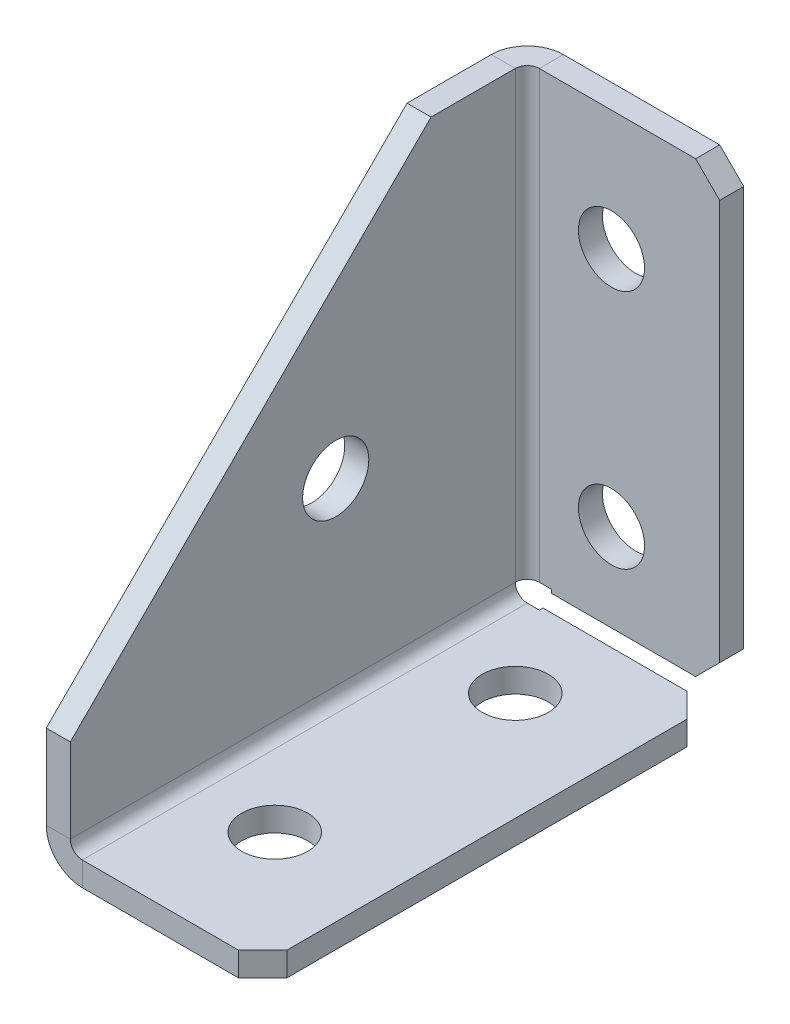
ISO-10303-21;
HEADER;
FILE_DESCRIPTION(('STEP AP214'),'2;1');
FILE_NAME('part.step','',(''),(''),'','','');
FILE_SCHEMA(('AUTOMOTIVE_DESIGN { 1 0 10303 214 1 1 1 1 }'));
ENDSEC;
DATA;
#1=APPLICATION_CONTEXT('core data for automotive mechanical design processes');
#2=APPLICATION_PROTOCOL_DEFINITION('international standard','automotive_design',2000,#1);
#3=PRODUCT_CONTEXT('',#1,'mechanical');
#4=PRODUCT('Part','Part','',(#3));
#5=PRODUCT_RELATED_PRODUCT_CATEGORY('part','',(#4));
#6=PRODUCT_DEFINITION_FORMATION('','',#4);
#7=PRODUCT_DEFINITION_CONTEXT('part definition',#1,'design');
#8=PRODUCT_DEFINITION('design','',#6,#7);
#9=PRODUCT_DEFINITION_SHAPE('','',#8);
#10=(LENGTH_UNIT() NAMED_UNIT(*) SI_UNIT(.MILLI.,.METRE.));
#11=(NAMED_UNIT(*) PLANE_ANGLE_UNIT() SI_UNIT($,.RADIAN.));
#12=(NAMED_UNIT(*) SI_UNIT($,.STERADIAN.) SOLID_ANGLE_UNIT());
#13=UNCERTAINTY_MEASURE_WITH_UNIT(LENGTH_MEASURE(1.E-05),#10,'distance_accuracy_value','');
#14=(GEOMETRIC_REPRESENTATION_CONTEXT(3) GLOBAL_UNCERTAINTY_ASSIGNED_CONTEXT((#13)) GLOBAL_UNIT_ASSIGNED_CONTEXT((#10,
#11,#12)) REPRESENTATION_CONTEXT('',''));
#15=CARTESIAN_POINT('',(0.,0.,0.));
#16=DIRECTION('',(0.,0.,1.));
#17=DIRECTION('',(1.,0.,0.));
#18=AXIS2_PLACEMENT_3D('',#15,#16,#17);
#19=CARTESIAN_POINT('',(3.,3.,2.99999999999998));
#20=DIRECTION('',(0.,0.,1.));
#21=DIRECTION('',(0.,-1.,0.));
#22=AXIS2_PLACEMENT_3D('',#19,#20,#21);
#23=PLANE('',#22);
#24=DIRECTION('',(-1.,0.,0.));
#25=VECTOR('',#24,1.);
#26=CARTESIAN_POINT('',(0.,2.99999999999998,2.99999999999998));
#27=LINE('',#26,#25);
#28=CARTESIAN_POINT('',(2.,2.99999999999998,2.99999999999999));
#29=VERTEX_POINT('',#28);
#30=CARTESIAN_POINT('',(0.,2.99999999999998,2.99999999999998));
#31=VERTEX_POINT('',#30);
#32=EDGE_CURVE('E411',#29,#31,#27,.T.);
#33=ORIENTED_EDGE('',*,*,#32,.F.);
#34=CARTESIAN_POINT('',(3.,3.,2.99999999999998));
#35=DIRECTION('',(0.,0.,-1.));
#36=DIRECTION('',(-1.,0.,0.));
#37=AXIS2_PLACEMENT_3D('',#34,#35,#36);
#38=CIRCLE('',#37,1.);
#39=CARTESIAN_POINT('',(3.,2.,2.99999999999998));
#40=VERTEX_POINT('',#39);
#41=EDGE_CURVE('E353',#29,#40,#38,.F.);
#42=ORIENTED_EDGE('',*,*,#41,.T.);
#43=DIRECTION('',(0.,-1.,0.));
#44=VECTOR('',#43,1.);
#45=CARTESIAN_POINT('',(3.,0.,2.99999999999998));
#46=LINE('',#45,#44);
#47=CARTESIAN_POINT('',(3.,0.,2.99999999999998));
#48=VERTEX_POINT('',#47);
#49=EDGE_CURVE('E408',#40,#48,#46,.T.);
#50=ORIENTED_EDGE('',*,*,#49,.T.);
#51=CARTESIAN_POINT('',(3.,3.,2.99999999999998));
#52=DIRECTION('',(0.,0.,-1.));
#53=DIRECTION('',(0.,1.,0.));
#54=AXIS2_PLACEMENT_3D('',#51,#52,#53);
#55=CIRCLE('',#54,3.);
#56=EDGE_CURVE('E291',#31,#48,#55,.F.);
#57=ORIENTED_EDGE('',*,*,#56,.F.);
#58=EDGE_LOOP('',(#33,#42,#50,#57));
#59=FACE_BOUND('',#58,.T.);
#60=ADVANCED_FACE('F48',(#59),#23,.F.);
#61=CARTESIAN_POINT('',(18.,0.,2.99999999999998));
#62=DIRECTION('',(0.,0.,1.));
#63=DIRECTION('',(1.,0.,0.));
#64=AXIS2_PLACEMENT_3D('',#61,#62,#63);
#65=PLANE('',#64);
#66=ORIENTED_EDGE('',*,*,#49,.F.);
#67=DIRECTION('',(1.,0.,0.));
#68=VECTOR('',#67,1.);
#69=CARTESIAN_POINT('',(18.,2.,2.99999999999998));
#70=LINE('',#69,#68);
#71=CARTESIAN_POINT('',(4.010301,2.,2.99999999999998));
#72=VERTEX_POINT('',#71);
#73=EDGE_CURVE('E322',#40,#72,#70,.T.);
#74=ORIENTED_EDGE('',*,*,#73,.T.);
#75=DIRECTION('',(0.,-1.,0.));
#76=VECTOR('',#75,1.);
#77=CARTESIAN_POINT('',(4.010301,0.,2.99999999999998));
#78=LINE('',#77,#76);
#79=CARTESIAN_POINT('',(4.010301,0.,2.99999999999998));
#80=VERTEX_POINT('',#79);
#81=EDGE_CURVE('E405',#72,#80,#78,.T.);
#82=ORIENTED_EDGE('',*,*,#81,.T.);
#83=DIRECTION('',(1.,0.,0.));
#84=VECTOR('',#83,1.);
#85=CARTESIAN_POINT('',(18.,0.,2.99999999999998));
#86=LINE('',#85,#84);
#87=EDGE_CURVE('E255',#48,#80,#86,.T.);
#88=ORIENTED_EDGE('',*,*,#87,.F.);
#89=EDGE_LOOP('',(#66,#74,#82,#88));
#90=FACE_BOUND('',#89,.T.);
#91=ADVANCED_FACE('F530',(#90),#65,.F.);
#92=CARTESIAN_POINT('',(4.010301,0.,40.));
#93=DIRECTION('',(-1.,0.,0.));
#94=DIRECTION('',(0.,0.,1.));
#95=AXIS2_PLACEMENT_3D('',#92,#93,#94);
#96=PLANE('',#95);
#97=ORIENTED_EDGE('',*,*,#81,.F.);
#98=DIRECTION('',(0.,0.,1.));
#99=VECTOR('',#98,1.);
#100=CARTESIAN_POINT('',(4.010301,2.,40.));
#101=LINE('',#100,#99);
#102=CARTESIAN_POINT('',(4.010301,2.,2.70710678118655));
#103=VERTEX_POINT('',#102);
#104=EDGE_CURVE('E363',#103,#72,#101,.T.);
#105=ORIENTED_EDGE('',*,*,#104,.F.);
#106=DIRECTION('',(0.,-1.,0.));
#107=VECTOR('',#106,1.);
#108=CARTESIAN_POINT('',(4.010301,0.,2.70710678118655));
#109=LINE('',#108,#107);
#110=CARTESIAN_POINT('',(4.010301,0.,2.70710678118655));
#111=VERTEX_POINT('',#110);
#112=EDGE_CURVE('E402',#103,#111,#109,.T.);
#113=ORIENTED_EDGE('',*,*,#112,.T.);
#114=DIRECTION('',(0.,0.,1.));
#115=VECTOR('',#114,1.);
#116=CARTESIAN_POINT('',(4.010301,0.,40.));
#117=LINE('',#116,#115);
#118=EDGE_CURVE('E251',#111,#80,#117,.T.);
#119=ORIENTED_EDGE('',*,*,#118,.T.);
#120=EDGE_LOOP('',(#97,#105,#113,#119));
#121=FACE_BOUND('',#120,.T.);
#122=ADVANCED_FACE('F535',(#121),#96,.T.);
#123=CARTESIAN_POINT('',(18.,0.,2.70710678118655));
#124=DIRECTION('',(0.,0.,1.));
#125=DIRECTION('',(1.,0.,0.));
#126=AXIS2_PLACEMENT_3D('',#123,#124,#125);
#127=PLANE('',#126);
#128=DIRECTION('',(1.,0.,0.));
#129=VECTOR('',#128,1.);
#130=CARTESIAN_POINT('',(18.,2.,2.70710678118655));
#131=LINE('',#130,#129);
#132=CARTESIAN_POINT('',(16.,2.,2.70710678118655));
#133=VERTEX_POINT('',#132);
#134=EDGE_CURVE('E326',#103,#133,#131,.T.);
#135=ORIENTED_EDGE('',*,*,#134,.T.);
#136=DIRECTION('',(0.,1.,0.));
#137=VECTOR('',#136,1.);
#138=CARTESIAN_POINT('',(16.,0.,2.70710678118655));
#139=LINE('',#138,#137);
#140=CARTESIAN_POINT('',(16.,0.,2.70710678118655));
#141=VERTEX_POINT('',#140);
#142=EDGE_CURVE('E438',#133,#141,#139,.F.);
#143=ORIENTED_EDGE('',*,*,#142,.T.);
#144=DIRECTION('',(1.,0.,0.));
#145=VECTOR('',#144,1.);
#146=CARTESIAN_POINT('',(18.,0.,2.70710678118655));
#147=LINE('',#146,#145);
#148=EDGE_CURVE('E247',#111,#141,#147,.T.);
#149=ORIENTED_EDGE('',*,*,#148,.F.);
#150=ORIENTED_EDGE('',*,*,#112,.F.);
#151=EDGE_LOOP('',(#135,#143,#149,#150));
#152=FACE_BOUND('',#151,.T.);
#153=ADVANCED_FACE('F576',(#152),#127,.F.);
#154=CARTESIAN_POINT('',(18.,0.,40.));
#155=DIRECTION('',(1.,0.,0.));
#156=DIRECTION('',(0.,0.,-1.));
#157=AXIS2_PLACEMENT_3D('',#154,#155,#156);
#158=PLANE('',#157);
#159=DIRECTION('',(0.,0.,1.));
#160=VECTOR('',#159,1.);
#161=CARTESIAN_POINT('',(18.,2.,40.));
#162=LINE('',#161,#160);
#163=CARTESIAN_POINT('',(18.,2.,38.));
#164=VERTEX_POINT('',#163);
#165=CARTESIAN_POINT('',(18.,2.,4.70710678118656));
#166=VERTEX_POINT('',#165);
#167=EDGE_CURVE('E356',#164,#166,#162,.F.);
#168=ORIENTED_EDGE('',*,*,#167,.F.);
#169=DIRECTION('',(0.,-1.,0.));
#170=VECTOR('',#169,1.);
#171=CARTESIAN_POINT('',(18.,0.,38.));
#172=LINE('',#171,#170);
#173=CARTESIAN_POINT('',(18.,0.,38.));
#174=VERTEX_POINT('',#173);
#175=EDGE_CURVE('E419',#164,#174,#172,.T.);
#176=ORIENTED_EDGE('',*,*,#175,.T.);
#177=DIRECTION('',(0.,0.,-1.));
#178=VECTOR('',#177,1.);
#179=CARTESIAN_POINT('',(18.,0.,40.));
#180=LINE('',#179,#178);
#181=CARTESIAN_POINT('',(18.,0.,4.70710678118656));
#182=VERTEX_POINT('',#181);
#183=EDGE_CURVE('E284',#174,#182,#180,.T.);
#184=ORIENTED_EDGE('',*,*,#183,.T.);
#185=DIRECTION('',(0.,1.,0.));
#186=VECTOR('',#185,1.);
#187=CARTESIAN_POINT('',(18.,0.,4.70710678118656));
#188=LINE('',#187,#186);
#189=EDGE_CURVE('E414',#182,#166,#188,.T.);
#190=ORIENTED_EDGE('',*,*,#189,.T.);
#191=EDGE_LOOP('',(#168,#176,#184,#190));
#192=FACE_BOUND('',#191,.T.);
#193=ADVANCED_FACE('F590',(#192),#158,.T.);
#194=CARTESIAN_POINT('',(18.,0.,40.));
#195=DIRECTION('',(0.,0.,-1.));
#196=DIRECTION('',(-1.,0.,0.));
#197=AXIS2_PLACEMENT_3D('',#194,#195,#196);
#198=PLANE('',#197);
#199=DIRECTION('',(-1.,0.,0.));
#200=VECTOR('',#199,1.);
#201=CARTESIAN_POINT('',(18.,0.,40.));
#202=LINE('',#201,#200);
#203=CARTESIAN_POINT('',(16.,0.,40.));
#204=VERTEX_POINT('',#203);
#205=CARTESIAN_POINT('',(3.,0.,40.));
#206=VERTEX_POINT('',#205);
#207=EDGE_CURVE('E221',#204,#206,#202,.T.);
#208=ORIENTED_EDGE('',*,*,#207,.F.);
#209=DIRECTION('',(0.,-1.,0.));
#210=VECTOR('',#209,1.);
#211=CARTESIAN_POINT('',(16.,0.,40.));
#212=LINE('',#211,#210);
#213=CARTESIAN_POINT('',(16.,2.,40.));
#214=VERTEX_POINT('',#213);
#215=EDGE_CURVE('E429',#204,#214,#212,.F.);
#216=ORIENTED_EDGE('',*,*,#215,.T.);
#217=DIRECTION('',(1.,0.,0.));
#218=VECTOR('',#217,1.);
#219=CARTESIAN_POINT('',(18.,2.,40.));
#220=LINE('',#219,#218);
#221=CARTESIAN_POINT('',(3.,2.,40.));
#222=VERTEX_POINT('',#221);
#223=EDGE_CURVE('E349',#214,#222,#220,.F.);
#224=ORIENTED_EDGE('',*,*,#223,.T.);
#225=DIRECTION('',(0.,-1.,0.));
#226=VECTOR('',#225,1.);
#227=CARTESIAN_POINT('',(3.,0.,40.));
#228=LINE('',#227,#226);
#229=EDGE_CURVE('E398',#222,#206,#228,.T.);
#230=ORIENTED_EDGE('',*,*,#229,.T.);
#231=EDGE_LOOP('',(#208,#216,#224,#230));
#232=FACE_BOUND('',#231,.T.);
#233=ADVANCED_FACE('F700',(#232),#198,.F.);
#234=CARTESIAN_POINT('',(3.,3.,40.));
#235=DIRECTION('',(0.,0.,1.));
#236=DIRECTION('',(1.,0.,0.));
#237=AXIS2_PLACEMENT_3D('',#234,#235,#236);
#238=PLANE('',#237);
#239=ORIENTED_EDGE('',*,*,#229,.F.);
#240=CARTESIAN_POINT('',(3.,3.,40.));
#241=DIRECTION('',(0.,0.,-1.));
#242=DIRECTION('',(-1.,0.,0.));
#243=AXIS2_PLACEMENT_3D('',#240,#241,#242);
#244=CIRCLE('',#243,1.);
#245=CARTESIAN_POINT('',(2.,3.,40.));
#246=VERTEX_POINT('',#245);
#247=EDGE_CURVE('E339',#222,#246,#244,.T.);
#248=ORIENTED_EDGE('',*,*,#247,.T.);
#249=DIRECTION('',(-1.,0.,0.));
#250=VECTOR('',#249,1.);
#251=CARTESIAN_POINT('',(0.,3.,40.));
#252=LINE('',#251,#250);
#253=CARTESIAN_POINT('',(0.,3.,40.));
#254=VERTEX_POINT('',#253);
#255=EDGE_CURVE('E207',#246,#254,#252,.T.);
#256=ORIENTED_EDGE('',*,*,#255,.T.);
#257=CARTESIAN_POINT('',(3.,3.,40.));
#258=DIRECTION('',(0.,0.,-1.));
#259=DIRECTION('',(-1.,0.,0.));
#260=AXIS2_PLACEMENT_3D('',#257,#258,#259);
#261=CIRCLE('',#260,3.);
#262=EDGE_CURVE('E280',#206,#254,#261,.T.);
#263=ORIENTED_EDGE('',*,*,#262,.F.);
#264=EDGE_LOOP('',(#239,#248,#256,#263));
#265=FACE_BOUND('',#264,.T.);
#266=ADVANCED_FACE('F502',(#265),#238,.T.);
#267=CARTESIAN_POINT('',(0.,10.,40.));
#268=DIRECTION('',(0.,0.,1.));
#269=DIRECTION('',(0.,-1.,0.));
#270=AXIS2_PLACEMENT_3D('',#267,#268,#269);
#271=PLANE('',#270);
#272=ORIENTED_EDGE('',*,*,#255,.F.);
#273=DIRECTION('',(0.,1.,0.));
#274=VECTOR('',#273,1.);
#275=CARTESIAN_POINT('',(2.,0.,40.));
#276=LINE('',#275,#274);
#277=CARTESIAN_POINT('',(2.,10.,40.));
#278=VERTEX_POINT('',#277);
#279=EDGE_CURVE('E201',#278,#246,#276,.F.);
#280=ORIENTED_EDGE('',*,*,#279,.F.);
#281=DIRECTION('',(-1.,0.,0.));
#282=VECTOR('',#281,1.);
#283=CARTESIAN_POINT('',(0.,10.,40.));
#284=LINE('',#283,#282);
#285=CARTESIAN_POINT('',(0.,10.,40.));
#286=VERTEX_POINT('',#285);
#287=EDGE_CURVE('E195',#278,#286,#284,.T.);
#288=ORIENTED_EDGE('',*,*,#287,.T.);
#289=DIRECTION('',(0.,-1.,0.));
#290=VECTOR('',#289,1.);
#291=CARTESIAN_POINT('',(0.,10.,40.));
#292=LINE('',#291,#290);
#293=EDGE_CURVE('E198',#286,#254,#292,.T.);
#294=ORIENTED_EDGE('',*,*,#293,.T.);
#295=EDGE_LOOP('',(#272,#280,#288,#294));
#296=FACE_BOUND('',#295,.T.);
#297=ADVANCED_FACE('F197',(#296),#271,.T.);
#298=CARTESIAN_POINT('',(0.,40.,10.));
#299=DIRECTION('',(0.,0.707106781186547,0.707106781186548));
#300=DIRECTION('',(0.,-0.707106781186548,0.707106781186547));
#301=AXIS2_PLACEMENT_3D('',#298,#299,#300);
#302=PLANE('',#301);
#303=ORIENTED_EDGE('',*,*,#287,.F.);
#304=DIRECTION('',(0.,-0.707106781186548,0.707106781186547));
#305=VECTOR('',#304,1.);
#306=CARTESIAN_POINT('',(2.,40.,10.));
#307=LINE('',#306,#305);
#308=CARTESIAN_POINT('',(2.,40.,10.));
#309=VERTEX_POINT('',#308);
#310=EDGE_CURVE('E344',#309,#278,#307,.T.);
#311=ORIENTED_EDGE('',*,*,#310,.F.);
#312=DIRECTION('',(-1.,0.,0.));
#313=VECTOR('',#312,1.);
#314=CARTESIAN_POINT('',(0.,40.,10.));
#315=LINE('',#314,#313);
#316=CARTESIAN_POINT('',(0.,40.,10.));
#317=VERTEX_POINT('',#316);
#318=EDGE_CURVE('E208',#309,#317,#315,.T.);
#319=ORIENTED_EDGE('',*,*,#318,.T.);
#320=DIRECTION('',(0.,-0.707106781186548,0.707106781186547));
#321=VECTOR('',#320,1.);
#322=CARTESIAN_POINT('',(0.,40.,10.));
#323=LINE('',#322,#321);
#324=EDGE_CURVE('E216',#317,#286,#323,.T.);
#325=ORIENTED_EDGE('',*,*,#324,.T.);
#326=EDGE_LOOP('',(#303,#311,#319,#325));
#327=FACE_BOUND('',#326,.T.);
#328=ADVANCED_FACE('F223',(#327),#302,.T.);
#329=CARTESIAN_POINT('',(0.,40.,0.));
#330=DIRECTION('',(0.,1.,0.));
#331=DIRECTION('',(0.,0.,1.));
#332=AXIS2_PLACEMENT_3D('',#329,#330,#331);
#333=PLANE('',#332);
#334=ORIENTED_EDGE('',*,*,#318,.F.);
#335=DIRECTION('',(0.,0.,-1.));
#336=VECTOR('',#335,1.);
#337=CARTESIAN_POINT('',(2.,40.,0.));
#338=LINE('',#337,#336);
#339=CARTESIAN_POINT('',(2.,40.,3.00000000000002));
#340=VERTEX_POINT('',#339);
#341=EDGE_CURVE('E340',#340,#309,#338,.F.);
#342=ORIENTED_EDGE('',*,*,#341,.F.);
#343=DIRECTION('',(-1.,0.,0.));
#344=VECTOR('',#343,1.);
#345=CARTESIAN_POINT('',(0.,40.,3.00000000000002));
#346=LINE('',#345,#344);
#347=CARTESIAN_POINT('',(0.,40.,3.00000000000002));
#348=VERTEX_POINT('',#347);
#349=EDGE_CURVE('E391',#340,#348,#346,.T.);
#350=ORIENTED_EDGE('',*,*,#349,.T.);
#351=DIRECTION('',(0.,0.,1.));
#352=VECTOR('',#351,1.);
#353=CARTESIAN_POINT('',(0.,40.,0.));
#354=LINE('',#353,#352);
#355=EDGE_CURVE('E225',#348,#317,#354,.T.);
#356=ORIENTED_EDGE('',*,*,#355,.T.);
#357=EDGE_LOOP('',(#334,#342,#350,#356));
#358=FACE_BOUND('',#357,.T.);
#359=ADVANCED_FACE('F515',(#358),#333,.T.);
#360=CARTESIAN_POINT('',(3.,40.,3.00000000000002));
#361=DIRECTION('',(0.,-1.,0.));
#362=DIRECTION('',(0.,0.,-1.));
#363=AXIS2_PLACEMENT_3D('',#360,#361,#362);
#364=PLANE('',#363);
#365=ORIENTED_EDGE('',*,*,#349,.F.);
#366=CARTESIAN_POINT('',(3.,40.,3.00000000000002));
#367=DIRECTION('',(0.,1.,0.));
#368=DIRECTION('',(0.,0.,1.));
#369=AXIS2_PLACEMENT_3D('',#366,#367,#368);
#370=CIRCLE('',#369,1.);
#371=CARTESIAN_POINT('',(3.,40.,2.00000000000002));
#372=VERTEX_POINT('',#371);
#373=EDGE_CURVE('E334',#340,#372,#370,.F.);
#374=ORIENTED_EDGE('',*,*,#373,.T.);
#375=DIRECTION('',(0.,0.,-1.));
#376=VECTOR('',#375,1.);
#377=CARTESIAN_POINT('',(3.,40.,0.));
#378=LINE('',#377,#376);
#379=CARTESIAN_POINT('',(3.,40.,0.));
#380=VERTEX_POINT('',#379);
#381=EDGE_CURVE('E387',#372,#380,#378,.T.);
#382=ORIENTED_EDGE('',*,*,#381,.T.);
#383=CARTESIAN_POINT('',(3.,40.,3.00000000000002));
#384=DIRECTION('',(0.,1.,0.));
#385=DIRECTION('',(0.,0.,1.));
#386=AXIS2_PLACEMENT_3D('',#383,#384,#385);
#387=CIRCLE('',#386,3.);
#388=EDGE_CURVE('E275',#348,#380,#387,.F.);
#389=ORIENTED_EDGE('',*,*,#388,.F.);
#390=EDGE_LOOP('',(#365,#374,#382,#389));
#391=FACE_BOUND('',#390,.T.);
#392=ADVANCED_FACE('F517',(#391),#364,.F.);
#393=CARTESIAN_POINT('',(18.,40.,0.));
#394=DIRECTION('',(0.,1.,0.));
#395=DIRECTION('',(-1.,0.,0.));
#396=AXIS2_PLACEMENT_3D('',#393,#394,#395);
#397=PLANE('',#396);
#398=DIRECTION('',(1.,0.,0.));
#399=VECTOR('',#398,1.);
#400=CARTESIAN_POINT('',(18.,40.,2.00000000000002));
#401=LINE('',#400,#399);
#402=CARTESIAN_POINT('',(16.,40.,2.00000000000002));
#403=VERTEX_POINT('',#402);
#404=EDGE_CURVE('E330',#403,#372,#401,.F.);
#405=ORIENTED_EDGE('',*,*,#404,.F.);
#406=DIRECTION('',(0.,0.,-1.));
#407=VECTOR('',#406,1.);
#408=CARTESIAN_POINT('',(16.,40.,0.));
#409=LINE('',#408,#407);
#410=CARTESIAN_POINT('',(16.,40.,0.));
#411=VERTEX_POINT('',#410);
#412=EDGE_CURVE('E11',#403,#411,#409,.T.);
#413=ORIENTED_EDGE('',*,*,#412,.T.);
#414=DIRECTION('',(-1.,0.,0.));
#415=VECTOR('',#414,1.);
#416=CARTESIAN_POINT('',(18.,40.,0.));
#417=LINE('',#416,#415);
#418=EDGE_CURVE('E237',#411,#380,#417,.T.);
#419=ORIENTED_EDGE('',*,*,#418,.T.);
#420=ORIENTED_EDGE('',*,*,#381,.F.);
#421=EDGE_LOOP('',(#405,#413,#419,#420));
#422=FACE_BOUND('',#421,.T.);
#423=ADVANCED_FACE('F521',(#422),#397,.T.);
#424=CARTESIAN_POINT('',(18.,0.,0.));
#425=DIRECTION('',(1.,0.,0.));
#426=DIRECTION('',(0.,1.,0.));
#427=AXIS2_PLACEMENT_3D('',#424,#425,#426);
#428=PLANE('',#427);
#429=DIRECTION('',(0.,-1.,0.));
#430=VECTOR('',#429,1.);
#431=CARTESIAN_POINT('',(18.,0.,2.));
#432=LINE('',#431,#430);
#433=CARTESIAN_POINT('',(18.,4.70710678118655,2.));
#434=VERTEX_POINT('',#433);
#435=CARTESIAN_POINT('',(18.,38.,2.00000000000002));
#436=VERTEX_POINT('',#435);
#437=EDGE_CURVE('E327',#434,#436,#432,.F.);
#438=ORIENTED_EDGE('',*,*,#437,.F.);
#439=DIRECTION('',(0.,0.,-1.));
#440=VECTOR('',#439,1.);
#441=CARTESIAN_POINT('',(18.,4.70710678118655,0.));
#442=LINE('',#441,#440);
#443=CARTESIAN_POINT('',(18.,4.70710678118655,0.));
#444=VERTEX_POINT('',#443);
#445=EDGE_CURVE('E445',#434,#444,#442,.T.);
#446=ORIENTED_EDGE('',*,*,#445,.T.);
#447=DIRECTION('',(0.,1.,0.));
#448=VECTOR('',#447,1.);
#449=CARTESIAN_POINT('',(18.,0.,0.));
#450=LINE('',#449,#448);
#451=CARTESIAN_POINT('',(18.,38.,0.));
#452=VERTEX_POINT('',#451);
#453=EDGE_CURVE('E240',#444,#452,#450,.T.);
#454=ORIENTED_EDGE('',*,*,#453,.T.);
#455=DIRECTION('',(0.,0.,1.));
#456=VECTOR('',#455,1.);
#457=CARTESIAN_POINT('',(18.,38.,0.));
#458=LINE('',#457,#456);
#459=EDGE_CURVE('E442',#452,#436,#458,.T.);
#460=ORIENTED_EDGE('',*,*,#459,.T.);
#461=EDGE_LOOP('',(#438,#446,#454,#460));
#462=FACE_BOUND('',#461,.T.);
#463=ADVANCED_FACE('F467',(#462),#428,.T.);
#464=CARTESIAN_POINT('',(18.,2.70710678118655,0.));
#465=DIRECTION('',(0.,1.,0.));
#466=DIRECTION('',(-1.,0.,0.));
#467=AXIS2_PLACEMENT_3D('',#464,#465,#466);
#468=PLANE('',#467);
#469=DIRECTION('',(-1.,0.,0.));
#470=VECTOR('',#469,1.);
#471=CARTESIAN_POINT('',(18.,2.70710678118655,0.));
#472=LINE('',#471,#470);
#473=CARTESIAN_POINT('',(16.,2.70710678118655,0.));
#474=VERTEX_POINT('',#473);
#475=CARTESIAN_POINT('',(4.010301,2.70710678118655,0.));
#476=VERTEX_POINT('',#475);
#477=EDGE_CURVE('E244',#474,#476,#472,.T.);
#478=ORIENTED_EDGE('',*,*,#477,.F.);
#479=DIRECTION('',(0.,0.,-1.));
#480=VECTOR('',#479,1.);
#481=CARTESIAN_POINT('',(16.,2.70710678118655,0.));
#482=LINE('',#481,#480);
#483=CARTESIAN_POINT('',(16.,2.70710678118655,2.));
#484=VERTEX_POINT('',#483);
#485=EDGE_CURVE('E73',#474,#484,#482,.F.);
#486=ORIENTED_EDGE('',*,*,#485,.T.);
#487=DIRECTION('',(1.,0.,0.));
#488=VECTOR('',#487,1.);
#489=CARTESIAN_POINT('',(18.,2.70710678118655,2.));
#490=LINE('',#489,#488);
#491=CARTESIAN_POINT('',(4.010301,2.70710678118655,2.));
#492=VERTEX_POINT('',#491);
#493=EDGE_CURVE('E323',#484,#492,#490,.F.);
#494=ORIENTED_EDGE('',*,*,#493,.T.);
#495=DIRECTION('',(0.,0.,-1.));
#496=VECTOR('',#495,1.);
#497=CARTESIAN_POINT('',(4.010301,2.70710678118655,0.));
#498=LINE('',#497,#496);
#499=EDGE_CURVE('E383',#492,#476,#498,.T.);
#500=ORIENTED_EDGE('',*,*,#499,.T.);
#501=EDGE_LOOP('',(#478,#486,#494,#500));
#502=FACE_BOUND('',#501,.T.);
#503=ADVANCED_FACE('F474',(#502),#468,.F.);
#504=CARTESIAN_POINT('',(4.010301,0.,0.));
#505=DIRECTION('',(-1.,0.,0.));
#506=DIRECTION('',(0.,-1.,0.));
#507=AXIS2_PLACEMENT_3D('',#504,#505,#506);
#508=PLANE('',#507);
#509=ORIENTED_EDGE('',*,*,#499,.F.);
#510=DIRECTION('',(0.,-1.,0.));
#511=VECTOR('',#510,1.);
#512=CARTESIAN_POINT('',(4.010301,0.,2.));
#513=LINE('',#512,#511);
#514=CARTESIAN_POINT('',(4.010301,2.99999999999998,2.));
#515=VERTEX_POINT('',#514);
#516=EDGE_CURVE('E318',#515,#492,#513,.T.);
#517=ORIENTED_EDGE('',*,*,#516,.F.);
#518=DIRECTION('',(0.,0.,-1.));
#519=VECTOR('',#518,1.);
#520=CARTESIAN_POINT('',(4.010301,2.99999999999998,0.));
#521=LINE('',#520,#519);
#522=CARTESIAN_POINT('',(4.010301,2.99999999999998,0.));
#523=VERTEX_POINT('',#522);
#524=EDGE_CURVE('E380',#515,#523,#521,.T.);
#525=ORIENTED_EDGE('',*,*,#524,.T.);
#526=DIRECTION('',(0.,-1.,0.));
#527=VECTOR('',#526,1.);
#528=CARTESIAN_POINT('',(4.010301,0.,0.));
#529=LINE('',#528,#527);
#530=EDGE_CURVE('E259',#523,#476,#529,.T.);
#531=ORIENTED_EDGE('',*,*,#530,.T.);
#532=EDGE_LOOP('',(#509,#517,#525,#531));
#533=FACE_BOUND('',#532,.T.);
#534=ADVANCED_FACE('F478',(#533),#508,.T.);
#535=CARTESIAN_POINT('',(18.,2.99999999999998,0.));
#536=DIRECTION('',(0.,1.,0.));
#537=DIRECTION('',(-1.,0.,0.));
#538=AXIS2_PLACEMENT_3D('',#535,#536,#537);
#539=PLANE('',#538);
#540=ORIENTED_EDGE('',*,*,#524,.F.);
#541=DIRECTION('',(1.,0.,0.));
#542=VECTOR('',#541,1.);
#543=CARTESIAN_POINT('',(18.,2.99999999999998,2.));
#544=LINE('',#543,#542);
#545=CARTESIAN_POINT('',(3.,2.99999999999998,2.));
#546=VERTEX_POINT('',#545);
#547=EDGE_CURVE('E304',#515,#546,#544,.F.);
#548=ORIENTED_EDGE('',*,*,#547,.T.);
#549=DIRECTION('',(0.,0.,-1.));
#550=VECTOR('',#549,1.);
#551=CARTESIAN_POINT('',(3.,2.99999999999998,0.));
#552=LINE('',#551,#550);
#553=CARTESIAN_POINT('',(3.,2.99999999999998,0.));
#554=VERTEX_POINT('',#553);
#555=EDGE_CURVE('E290',#546,#554,#552,.T.);
#556=ORIENTED_EDGE('',*,*,#555,.T.);
#557=DIRECTION('',(-1.,0.,0.));
#558=VECTOR('',#557,1.);
#559=CARTESIAN_POINT('',(18.,2.99999999999998,0.));
#560=LINE('',#559,#558);
#561=EDGE_CURVE('E263',#523,#554,#560,.T.);
#562=ORIENTED_EDGE('',*,*,#561,.F.);
#563=EDGE_LOOP('',(#540,#548,#556,#562));
#564=FACE_BOUND('',#563,.T.);
#565=ADVANCED_FACE('F482',(#564),#539,.F.);
#566=CARTESIAN_POINT('',(0.,17.9289321881345,17.9289321881345));
#567=DIRECTION('',(1.,0.,0.));
#568=DIRECTION('',(0.,0.,-1.));
#569=AXIS2_PLACEMENT_3D('',#566,#567,#568);
#570=CYLINDRICAL_SURFACE('',#569,2.75);
#571=CARTESIAN_POINT('',(0.,17.9289321881345,17.9289321881345));
#572=DIRECTION('',(1.,0.,0.));
#573=DIRECTION('',(0.,0.,-1.));
#574=AXIS2_PLACEMENT_3D('',#571,#572,#573);
#575=CIRCLE('',#574,2.75);
#576=CARTESIAN_POINT('',(0.,17.9289321881345,15.1789321881345));
#577=VERTEX_POINT('',#576);
#578=EDGE_CURVE('E230',#577,#577,#575,.T.);
#579=ORIENTED_EDGE('',*,*,#578,.F.);
#580=EDGE_LOOP('',(#579));
#581=FACE_BOUND('',#580,.T.);
#582=CARTESIAN_POINT('',(2.,17.9289321881345,17.9289321881345));
#583=DIRECTION('',(1.,0.,0.));
#584=DIRECTION('',(0.,0.,-1.));
#585=AXIS2_PLACEMENT_3D('',#582,#583,#584);
#586=CIRCLE('',#585,2.75);
#587=CARTESIAN_POINT('',(2.,17.9289321881345,15.1789321881345));
#588=VERTEX_POINT('',#587);
#589=EDGE_CURVE('E333',#588,#588,#586,.T.);
#590=ORIENTED_EDGE('',*,*,#589,.T.);
#591=EDGE_LOOP('',(#590));
#592=FACE_BOUND('',#591,.T.);
#593=ADVANCED_FACE('F542',(#581,#592),#570,.F.);
#594=CARTESIAN_POINT('',(3.,2.99999999999998,3.));
#595=DIRECTION('',(0.,1.,0.));
#596=DIRECTION('',(0.,0.,1.));
#597=AXIS2_PLACEMENT_3D('',#594,#595,#596);
#598=PLANE('',#597);
#599=CARTESIAN_POINT('',(3.,2.99999999999998,3.));
#600=DIRECTION('',(0.,1.,0.));
#601=DIRECTION('',(0.,0.,1.));
#602=AXIS2_PLACEMENT_3D('',#599,#600,#601);
#603=CIRCLE('',#602,1.);
#604=EDGE_CURVE('E338',#546,#29,#603,.T.);
#605=ORIENTED_EDGE('',*,*,#604,.T.);
#606=ORIENTED_EDGE('',*,*,#32,.T.);
#607=CARTESIAN_POINT('',(3.,2.99999999999998,3.));
#608=DIRECTION('',(0.,-1.,0.));
#609=DIRECTION('',(0.,0.,-1.));
#610=AXIS2_PLACEMENT_3D('',#607,#608,#609);
#611=CIRCLE('',#610,3.);
#612=EDGE_CURVE('E279',#554,#31,#611,.F.);
#613=ORIENTED_EDGE('',*,*,#612,.F.);
#614=ORIENTED_EDGE('',*,*,#555,.F.);
#615=EDGE_LOOP('',(#605,#606,#613,#614));
#616=FACE_BOUND('',#615,.T.);
#617=ADVANCED_FACE('F487',(#616),#598,.F.);
#618=CARTESIAN_POINT('',(18.,0.,0.));
#619=DIRECTION('',(0.,0.,1.));
#620=DIRECTION('',(0.,-1.,0.));
#621=AXIS2_PLACEMENT_3D('',#618,#619,#620);
#622=PLANE('',#621);
#623=CARTESIAN_POINT('',(9.,30.,0.));
#624=DIRECTION('',(0.,0.,1.));
#625=DIRECTION('',(0.,-1.,0.));
#626=AXIS2_PLACEMENT_3D('',#623,#624,#625);
#627=CIRCLE('',#626,2.75);
#628=CARTESIAN_POINT('',(9.,27.25,0.));
#629=VERTEX_POINT('',#628);
#630=EDGE_CURVE('E605',#629,#629,#627,.T.);
#631=ORIENTED_EDGE('',*,*,#630,.T.);
#632=EDGE_LOOP('',(#631));
#633=FACE_BOUND('',#632,.T.);
#634=CARTESIAN_POINT('',(9.,10.,0.));
#635=DIRECTION('',(0.,0.,1.));
#636=DIRECTION('',(0.,-1.,0.));
#637=AXIS2_PLACEMENT_3D('',#634,#635,#636);
#638=CIRCLE('',#637,2.75);
#639=CARTESIAN_POINT('',(9.,7.25,0.));
#640=VERTEX_POINT('',#639);
#641=EDGE_CURVE('E373',#640,#640,#638,.T.);
#642=ORIENTED_EDGE('',*,*,#641,.T.);
#643=EDGE_LOOP('',(#642));
#644=FACE_BOUND('',#643,.T.);
#645=ORIENTED_EDGE('',*,*,#453,.F.);
#646=DIRECTION('',(-0.707106781186549,-0.707106781186546,0.));
#647=VECTOR('',#646,1.);
#648=CARTESIAN_POINT('',(18.,4.70710678118655,0.));
#649=LINE('',#648,#647);
#650=EDGE_CURVE('E452',#444,#474,#649,.T.);
#651=ORIENTED_EDGE('',*,*,#650,.T.);
#652=ORIENTED_EDGE('',*,*,#477,.T.);
#653=ORIENTED_EDGE('',*,*,#530,.F.);
#654=ORIENTED_EDGE('',*,*,#561,.T.);
#655=DIRECTION('',(0.,1.,0.));
#656=VECTOR('',#655,1.);
#657=CARTESIAN_POINT('',(3.,0.,0.));
#658=LINE('',#657,#656);
#659=EDGE_CURVE('E267',#554,#380,#658,.T.);
#660=ORIENTED_EDGE('',*,*,#659,.T.);
#661=ORIENTED_EDGE('',*,*,#418,.F.);
#662=DIRECTION('',(-0.707106781186546,0.707106781186549,0.));
#663=VECTOR('',#662,1.);
#664=CARTESIAN_POINT('',(16.,40.,0.));
#665=LINE('',#664,#663);
#666=EDGE_CURVE('E449',#411,#452,#665,.F.);
#667=ORIENTED_EDGE('',*,*,#666,.T.);
#668=EDGE_LOOP('',(#645,#651,#652,#653,#654,#660,#661,#667));
#669=FACE_BOUND('',#668,.T.);
#670=ADVANCED_FACE('F472',(#633,#644,#669),#622,.F.);
#671=CARTESIAN_POINT('',(0.,0.,0.));
#672=DIRECTION('',(1.,0.,0.));
#673=DIRECTION('',(0.,0.,-1.));
#674=AXIS2_PLACEMENT_3D('',#671,#672,#673);
#675=PLANE('',#674);
#676=DIRECTION('',(0.,1.,0.));
#677=VECTOR('',#676,1.);
#678=CARTESIAN_POINT('',(0.,0.,3.));
#679=LINE('',#678,#677);
#680=EDGE_CURVE('E271',#348,#31,#679,.F.);
#681=ORIENTED_EDGE('',*,*,#680,.T.);
#682=DIRECTION('',(0.,0.,-1.));
#683=VECTOR('',#682,1.);
#684=CARTESIAN_POINT('',(0.,3.,0.));
#685=LINE('',#684,#683);
#686=EDGE_CURVE('E219',#31,#254,#685,.F.);
#687=ORIENTED_EDGE('',*,*,#686,.T.);
#688=ORIENTED_EDGE('',*,*,#293,.F.);
#689=ORIENTED_EDGE('',*,*,#324,.F.);
#690=ORIENTED_EDGE('',*,*,#355,.F.);
#691=EDGE_LOOP('',(#681,#687,#688,#689,#690));
#692=FACE_BOUND('',#691,.T.);
#693=ORIENTED_EDGE('',*,*,#578,.T.);
#694=EDGE_LOOP('',(#693));
#695=FACE_BOUND('',#694,.T.);
#696=ADVANCED_FACE('F213',(#692,#695),#675,.F.);
#697=CARTESIAN_POINT('',(18.,0.,40.));
#698=DIRECTION('',(0.,1.,0.));
#699=DIRECTION('',(0.,0.,1.));
#700=AXIS2_PLACEMENT_3D('',#697,#698,#699);
#701=PLANE('',#700);
#702=CARTESIAN_POINT('',(9.,0.,30.));
#703=DIRECTION('',(0.,1.,0.));
#704=DIRECTION('',(0.,0.,1.));
#705=AXIS2_PLACEMENT_3D('',#702,#703,#704);
#706=CIRCLE('',#705,2.74999999999999);
#707=CARTESIAN_POINT('',(9.,0.,32.75));
#708=VERTEX_POINT('',#707);
#709=EDGE_CURVE('E621',#708,#708,#706,.T.);
#710=ORIENTED_EDGE('',*,*,#709,.T.);
#711=EDGE_LOOP('',(#710));
#712=FACE_BOUND('',#711,.T.);
#713=CARTESIAN_POINT('',(9.,0.,10.));
#714=DIRECTION('',(0.,1.,0.));
#715=DIRECTION('',(0.,0.,1.));
#716=AXIS2_PLACEMENT_3D('',#713,#714,#715);
#717=CIRCLE('',#716,2.74999999999999);
#718=CARTESIAN_POINT('',(9.,0.,12.75));
#719=VERTEX_POINT('',#718);
#720=EDGE_CURVE('E613',#719,#719,#717,.T.);
#721=ORIENTED_EDGE('',*,*,#720,.T.);
#722=EDGE_LOOP('',(#721));
#723=FACE_BOUND('',#722,.T.);
#724=ORIENTED_EDGE('',*,*,#183,.F.);
#725=DIRECTION('',(-0.707106781186549,0.,0.707106781186546));
#726=VECTOR('',#725,1.);
#727=CARTESIAN_POINT('',(18.,0.,38.));
#728=LINE('',#727,#726);
#729=EDGE_CURVE('E426',#174,#204,#728,.T.);
#730=ORIENTED_EDGE('',*,*,#729,.T.);
#731=ORIENTED_EDGE('',*,*,#207,.T.);
#732=DIRECTION('',(0.,0.,-1.));
#733=VECTOR('',#732,1.);
#734=CARTESIAN_POINT('',(3.,0.,40.));
#735=LINE('',#734,#733);
#736=EDGE_CURVE('E274',#206,#48,#735,.T.);
#737=ORIENTED_EDGE('',*,*,#736,.T.);
#738=ORIENTED_EDGE('',*,*,#87,.T.);
#739=ORIENTED_EDGE('',*,*,#118,.F.);
#740=ORIENTED_EDGE('',*,*,#148,.T.);
#741=DIRECTION('',(0.707106781186546,0.,0.707106781186549));
#742=VECTOR('',#741,1.);
#743=CARTESIAN_POINT('',(16.,0.,2.70710678118655));
#744=LINE('',#743,#742);
#745=EDGE_CURVE('E423',#141,#182,#744,.T.);
#746=ORIENTED_EDGE('',*,*,#745,.T.);
#747=EDGE_LOOP('',(#724,#730,#731,#737,#738,#739,#740,#746));
#748=FACE_BOUND('',#747,.T.);
#749=ADVANCED_FACE('F582',(#712,#723,#748),#701,.F.);
#750=CARTESIAN_POINT('',(3.,0.,3.));
#751=DIRECTION('',(0.,1.,0.));
#752=DIRECTION('',(0.,0.,1.));
#753=AXIS2_PLACEMENT_3D('',#750,#751,#752);
#754=CYLINDRICAL_SURFACE('',#753,3.);
#755=ORIENTED_EDGE('',*,*,#612,.T.);
#756=ORIENTED_EDGE('',*,*,#680,.F.);
#757=ORIENTED_EDGE('',*,*,#388,.T.);
#758=ORIENTED_EDGE('',*,*,#659,.F.);
#759=EDGE_LOOP('',(#755,#756,#757,#758));
#760=FACE_BOUND('',#759,.T.);
#761=ADVANCED_FACE('F491',(#760),#754,.T.);
#762=CARTESIAN_POINT('',(3.,3.,40.));
#763=DIRECTION('',(0.,0.,-1.));
#764=DIRECTION('',(-1.,0.,0.));
#765=AXIS2_PLACEMENT_3D('',#762,#763,#764);
#766=CYLINDRICAL_SURFACE('',#765,3.);
#767=ORIENTED_EDGE('',*,*,#262,.T.);
#768=ORIENTED_EDGE('',*,*,#686,.F.);
#769=ORIENTED_EDGE('',*,*,#56,.T.);
#770=ORIENTED_EDGE('',*,*,#736,.F.);
#771=EDGE_LOOP('',(#767,#768,#769,#770));
#772=FACE_BOUND('',#771,.T.);
#773=ADVANCED_FACE('F498',(#772),#766,.T.);
#774=CARTESIAN_POINT('',(18.,0.,2.));
#775=DIRECTION('',(0.,0.,1.));
#776=DIRECTION('',(0.,-1.,0.));
#777=AXIS2_PLACEMENT_3D('',#774,#775,#776);
#778=PLANE('',#777);
#779=CARTESIAN_POINT('',(9.,30.,2.));
#780=DIRECTION('',(0.,0.,1.));
#781=DIRECTION('',(1.,0.,0.));
#782=AXIS2_PLACEMENT_3D('',#779,#780,#781);
#783=CIRCLE('',#782,2.75);
#784=CARTESIAN_POINT('',(11.75,30.,2.));
#785=VERTEX_POINT('',#784);
#786=EDGE_CURVE('E609',#785,#785,#783,.T.);
#787=ORIENTED_EDGE('',*,*,#786,.F.);
#788=EDGE_LOOP('',(#787));
#789=FACE_BOUND('',#788,.T.);
#790=CARTESIAN_POINT('',(9.,10.,2.));
#791=DIRECTION('',(0.,0.,1.));
#792=DIRECTION('',(1.,0.,0.));
#793=AXIS2_PLACEMENT_3D('',#790,#791,#792);
#794=CIRCLE('',#793,2.75);
#795=CARTESIAN_POINT('',(11.75,10.,2.));
#796=VERTEX_POINT('',#795);
#797=EDGE_CURVE('E601',#796,#796,#794,.T.);
#798=ORIENTED_EDGE('',*,*,#797,.F.);
#799=EDGE_LOOP('',(#798));
#800=FACE_BOUND('',#799,.T.);
#801=ORIENTED_EDGE('',*,*,#493,.F.);
#802=DIRECTION('',(0.707106781186549,0.707106781186546,0.));
#803=VECTOR('',#802,1.);
#804=CARTESIAN_POINT('',(15.6464466094067,2.35355339059328,2.));
#805=LINE('',#804,#803);
#806=EDGE_CURVE('E58',#484,#434,#805,.T.);
#807=ORIENTED_EDGE('',*,*,#806,.T.);
#808=ORIENTED_EDGE('',*,*,#437,.T.);
#809=DIRECTION('',(0.707106781186546,-0.707106781186549,0.));
#810=VECTOR('',#809,1.);
#811=CARTESIAN_POINT('',(37.,18.9999999999999,2.00000000000001));
#812=LINE('',#811,#810);
#813=EDGE_CURVE('E65',#436,#403,#812,.F.);
#814=ORIENTED_EDGE('',*,*,#813,.T.);
#815=ORIENTED_EDGE('',*,*,#404,.T.);
#816=DIRECTION('',(0.,-1.,0.));
#817=VECTOR('',#816,1.);
#818=CARTESIAN_POINT('',(3.,0.,2.));
#819=LINE('',#818,#817);
#820=EDGE_CURVE('E299',#546,#372,#819,.F.);
#821=ORIENTED_EDGE('',*,*,#820,.F.);
#822=ORIENTED_EDGE('',*,*,#547,.F.);
#823=ORIENTED_EDGE('',*,*,#516,.T.);
#824=EDGE_LOOP('',(#801,#807,#808,#814,#815,#821,#822,#823));
#825=FACE_BOUND('',#824,.T.);
#826=ADVANCED_FACE('F463',(#789,#800,#825),#778,.T.);
#827=CARTESIAN_POINT('',(2.,0.,0.));
#828=DIRECTION('',(1.,0.,0.));
#829=DIRECTION('',(0.,0.,-1.));
#830=AXIS2_PLACEMENT_3D('',#827,#828,#829);
#831=PLANE('',#830);
#832=DIRECTION('',(0.,1.,0.));
#833=VECTOR('',#832,1.);
#834=CARTESIAN_POINT('',(2.,0.,3.00000000000002));
#835=LINE('',#834,#833);
#836=EDGE_CURVE('E303',#340,#29,#835,.F.);
#837=ORIENTED_EDGE('',*,*,#836,.F.);
#838=ORIENTED_EDGE('',*,*,#341,.T.);
#839=ORIENTED_EDGE('',*,*,#310,.T.);
#840=ORIENTED_EDGE('',*,*,#279,.T.);
#841=DIRECTION('',(0.,0.,-1.));
#842=VECTOR('',#841,1.);
#843=CARTESIAN_POINT('',(2.,2.99999999999998,0.));
#844=LINE('',#843,#842);
#845=EDGE_CURVE('E295',#29,#246,#844,.F.);
#846=ORIENTED_EDGE('',*,*,#845,.F.);
#847=EDGE_LOOP('',(#837,#838,#839,#840,#846));
#848=FACE_BOUND('',#847,.T.);
#849=ORIENTED_EDGE('',*,*,#589,.F.);
#850=EDGE_LOOP('',(#849));
#851=FACE_BOUND('',#850,.T.);
#852=ADVANCED_FACE('F510',(#848,#851),#831,.T.);
#853=CARTESIAN_POINT('',(18.,2.,40.));
#854=DIRECTION('',(0.,1.,0.));
#855=DIRECTION('',(0.,0.,1.));
#856=AXIS2_PLACEMENT_3D('',#853,#854,#855);
#857=PLANE('',#856);
#858=CARTESIAN_POINT('',(9.,2.,30.));
#859=DIRECTION('',(0.,1.,0.));
#860=DIRECTION('',(0.,0.,1.));
#861=AXIS2_PLACEMENT_3D('',#858,#859,#860);
#862=CIRCLE('',#861,2.74999999999999);
#863=CARTESIAN_POINT('',(9.,2.,32.75));
#864=VERTEX_POINT('',#863);
#865=EDGE_CURVE('E625',#864,#864,#862,.T.);
#866=ORIENTED_EDGE('',*,*,#865,.F.);
#867=EDGE_LOOP('',(#866));
#868=FACE_BOUND('',#867,.T.);
#869=CARTESIAN_POINT('',(9.,2.,10.));
#870=DIRECTION('',(0.,1.,0.));
#871=DIRECTION('',(0.,0.,1.));
#872=AXIS2_PLACEMENT_3D('',#869,#870,#871);
#873=CIRCLE('',#872,2.74999999999999);
#874=CARTESIAN_POINT('',(9.,2.,12.75));
#875=VERTEX_POINT('',#874);
#876=EDGE_CURVE('E617',#875,#875,#873,.T.);
#877=ORIENTED_EDGE('',*,*,#876,.F.);
#878=EDGE_LOOP('',(#877));
#879=FACE_BOUND('',#878,.T.);
#880=ORIENTED_EDGE('',*,*,#223,.F.);
#881=DIRECTION('',(0.707106781186549,0.,-0.707106781186546));
#882=VECTOR('',#881,1.);
#883=CARTESIAN_POINT('',(17.,2.,39.));
#884=LINE('',#883,#882);
#885=EDGE_CURVE('E435',#214,#164,#884,.T.);
#886=ORIENTED_EDGE('',*,*,#885,.T.);
#887=ORIENTED_EDGE('',*,*,#167,.T.);
#888=DIRECTION('',(-0.707106781186546,0.,-0.707106781186549));
#889=VECTOR('',#888,1.);
#890=CARTESIAN_POINT('',(35.6464466094067,2.,22.3535533905933));
#891=LINE('',#890,#889);
#892=EDGE_CURVE('E432',#166,#133,#891,.T.);
#893=ORIENTED_EDGE('',*,*,#892,.T.);
#894=ORIENTED_EDGE('',*,*,#134,.F.);
#895=ORIENTED_EDGE('',*,*,#104,.T.);
#896=ORIENTED_EDGE('',*,*,#73,.F.);
#897=DIRECTION('',(0.,0.,1.));
#898=VECTOR('',#897,1.);
#899=CARTESIAN_POINT('',(3.,2.,40.));
#900=LINE('',#899,#898);
#901=EDGE_CURVE('E308',#222,#40,#900,.F.);
#902=ORIENTED_EDGE('',*,*,#901,.F.);
#903=EDGE_LOOP('',(#880,#886,#887,#893,#894,#895,#896,#902));
#904=FACE_BOUND('',#903,.T.);
#905=ADVANCED_FACE('F572',(#868,#879,#904),#857,.T.);
#906=CARTESIAN_POINT('',(3.,0.,3.));
#907=DIRECTION('',(0.,1.,0.));
#908=DIRECTION('',(0.,0.,1.));
#909=AXIS2_PLACEMENT_3D('',#906,#907,#908);
#910=CYLINDRICAL_SURFACE('',#909,1.);
#911=ORIENTED_EDGE('',*,*,#604,.F.);
#912=ORIENTED_EDGE('',*,*,#820,.T.);
#913=ORIENTED_EDGE('',*,*,#373,.F.);
#914=ORIENTED_EDGE('',*,*,#836,.T.);
#915=EDGE_LOOP('',(#911,#912,#913,#914));
#916=FACE_BOUND('',#915,.T.);
#917=ADVANCED_FACE('F635',(#916),#910,.F.);
#918=CARTESIAN_POINT('',(3.,3.,40.));
#919=DIRECTION('',(0.,0.,-1.));
#920=DIRECTION('',(-1.,0.,0.));
#921=AXIS2_PLACEMENT_3D('',#918,#919,#920);
#922=CYLINDRICAL_SURFACE('',#921,1.);
#923=ORIENTED_EDGE('',*,*,#247,.F.);
#924=ORIENTED_EDGE('',*,*,#901,.T.);
#925=ORIENTED_EDGE('',*,*,#41,.F.);
#926=ORIENTED_EDGE('',*,*,#845,.T.);
#927=EDGE_LOOP('',(#923,#924,#925,#926));
#928=FACE_BOUND('',#927,.T.);
#929=ADVANCED_FACE('F507',(#928),#922,.F.);
#930=CARTESIAN_POINT('',(9.,10.,2.));
#931=DIRECTION('',(0.,0.,1.));
#932=DIRECTION('',(1.,0.,0.));
#933=AXIS2_PLACEMENT_3D('',#930,#931,#932);
#934=CYLINDRICAL_SURFACE('',#933,2.75);
#935=ORIENTED_EDGE('',*,*,#641,.F.);
#936=EDGE_LOOP('',(#935));
#937=FACE_BOUND('',#936,.T.);
#938=ORIENTED_EDGE('',*,*,#797,.T.);
#939=EDGE_LOOP('',(#938));
#940=FACE_BOUND('',#939,.T.);
#941=ADVANCED_FACE('F650',(#937,#940),#934,.F.);
#942=CARTESIAN_POINT('',(9.,30.,2.));
#943=DIRECTION('',(0.,0.,1.));
#944=DIRECTION('',(1.,0.,0.));
#945=AXIS2_PLACEMENT_3D('',#942,#943,#944);
#946=CYLINDRICAL_SURFACE('',#945,2.75);
#947=ORIENTED_EDGE('',*,*,#630,.F.);
#948=EDGE_LOOP('',(#947));
#949=FACE_BOUND('',#948,.T.);
#950=ORIENTED_EDGE('',*,*,#786,.T.);
#951=EDGE_LOOP('',(#950));
#952=FACE_BOUND('',#951,.T.);
#953=ADVANCED_FACE('F641',(#949,#952),#946,.F.);
#954=CARTESIAN_POINT('',(9.,2.,10.));
#955=DIRECTION('',(0.,1.,0.));
#956=DIRECTION('',(0.,0.,1.));
#957=AXIS2_PLACEMENT_3D('',#954,#955,#956);
#958=CYLINDRICAL_SURFACE('',#957,2.74999999999999);
#959=ORIENTED_EDGE('',*,*,#720,.F.);
#960=EDGE_LOOP('',(#959));
#961=FACE_BOUND('',#960,.T.);
#962=ORIENTED_EDGE('',*,*,#876,.T.);
#963=EDGE_LOOP('',(#962));
#964=FACE_BOUND('',#963,.T.);
#965=ADVANCED_FACE('F639',(#961,#964),#958,.F.);
#966=CARTESIAN_POINT('',(9.,2.,30.));
#967=DIRECTION('',(0.,1.,0.));
#968=DIRECTION('',(0.,0.,1.));
#969=AXIS2_PLACEMENT_3D('',#966,#967,#968);
#970=CYLINDRICAL_SURFACE('',#969,2.74999999999999);
#971=ORIENTED_EDGE('',*,*,#709,.F.);
#972=EDGE_LOOP('',(#971));
#973=FACE_BOUND('',#972,.T.);
#974=ORIENTED_EDGE('',*,*,#865,.T.);
#975=EDGE_LOOP('',(#974));
#976=FACE_BOUND('',#975,.T.);
#977=ADVANCED_FACE('F553',(#973,#976),#970,.F.);
#978=CARTESIAN_POINT('',(18.,0.,38.));
#979=DIRECTION('',(0.707106781186546,0.,0.707106781186549));
#980=DIRECTION('',(0.,1.,0.));
#981=AXIS2_PLACEMENT_3D('',#978,#979,#980);
#982=PLANE('',#981);
#983=ORIENTED_EDGE('',*,*,#885,.F.);
#984=ORIENTED_EDGE('',*,*,#215,.F.);
#985=ORIENTED_EDGE('',*,*,#729,.F.);
#986=ORIENTED_EDGE('',*,*,#175,.F.);
#987=EDGE_LOOP('',(#983,#984,#985,#986));
#988=FACE_BOUND('',#987,.T.);
#989=ADVANCED_FACE('F547',(#988),#982,.T.);
#990=CARTESIAN_POINT('',(16.,0.,2.70710678118655));
#991=DIRECTION('',(0.707106781186549,0.,-0.707106781186546));
#992=DIRECTION('',(0.,1.,0.));
#993=AXIS2_PLACEMENT_3D('',#990,#991,#992);
#994=PLANE('',#993);
#995=ORIENTED_EDGE('',*,*,#892,.F.);
#996=ORIENTED_EDGE('',*,*,#189,.F.);
#997=ORIENTED_EDGE('',*,*,#745,.F.);
#998=ORIENTED_EDGE('',*,*,#142,.F.);
#999=EDGE_LOOP('',(#995,#996,#997,#998));
#1000=FACE_BOUND('',#999,.T.);
#1001=ADVANCED_FACE('F528',(#1000),#994,.T.);
#1002=CARTESIAN_POINT('',(18.,4.70710678118655,0.));
#1003=DIRECTION('',(0.707106781186546,-0.707106781186549,0.));
#1004=DIRECTION('',(0.,0.,1.));
#1005=AXIS2_PLACEMENT_3D('',#1002,#1003,#1004);
#1006=PLANE('',#1005);
#1007=ORIENTED_EDGE('',*,*,#806,.F.);
#1008=ORIENTED_EDGE('',*,*,#485,.F.);
#1009=ORIENTED_EDGE('',*,*,#650,.F.);
#1010=ORIENTED_EDGE('',*,*,#445,.F.);
#1011=EDGE_LOOP('',(#1007,#1008,#1009,#1010));
#1012=FACE_BOUND('',#1011,.T.);
#1013=ADVANCED_FACE('F470',(#1012),#1006,.T.);
#1014=CARTESIAN_POINT('',(16.,40.,0.));
#1015=DIRECTION('',(-0.707106781186549,-0.707106781186546,0.));
#1016=DIRECTION('',(0.,0.,-1.));
#1017=AXIS2_PLACEMENT_3D('',#1014,#1015,#1016);
#1018=PLANE('',#1017);
#1019=ORIENTED_EDGE('',*,*,#813,.F.);
#1020=ORIENTED_EDGE('',*,*,#459,.F.);
#1021=ORIENTED_EDGE('',*,*,#666,.F.);
#1022=ORIENTED_EDGE('',*,*,#412,.F.);
#1023=EDGE_LOOP('',(#1019,#1020,#1021,#1022));
#1024=FACE_BOUND('',#1023,.T.);
#1025=ADVANCED_FACE('F51',(#1024),#1018,.F.);
#1026=CLOSED_SHELL('',(#60,#91,#122,#153,#193,#233,#266,#297,#328,#359,#392,#423,#463,#503,#534,
#565,#593,#617,#670,#696,#749,#761,#773,#826,#852,#905,#917,#929,#941,#953,#965,#977,#989,#1001,
#1013,#1025));
#1027=MANIFOLD_SOLID_BREP('B2',#1026);
#1028=ADVANCED_BREP_SHAPE_REPRESENTATION('',(#18,#1027),#14);
#1029=SHAPE_DEFINITION_REPRESENTATION(#9,#1028);
ENDSEC;
END-ISO-10303-21;
